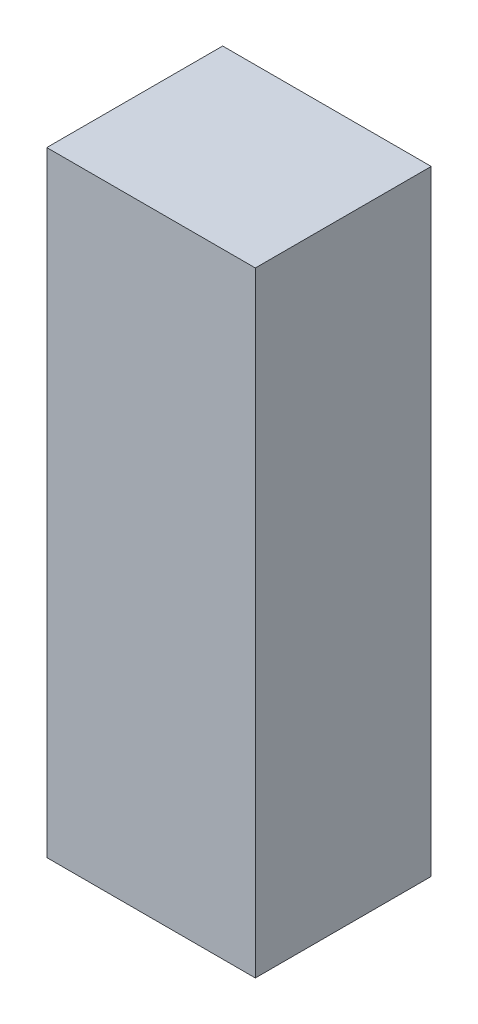
ISO-10303-21;
HEADER;
FILE_DESCRIPTION(('STEP AP214'),'2;1');
FILE_NAME('part.step','',(''),(''),'','','');
FILE_SCHEMA(('AUTOMOTIVE_DESIGN { 1 0 10303 214 1 1 1 1 }'));
ENDSEC;
DATA;
#1=APPLICATION_CONTEXT('core data for automotive mechanical design processes');
#2=APPLICATION_PROTOCOL_DEFINITION('international standard','automotive_design',2000,#1);
#3=PRODUCT_CONTEXT('',#1,'mechanical');
#4=PRODUCT('Part','Part','',(#3));
#5=PRODUCT_RELATED_PRODUCT_CATEGORY('part','',(#4));
#6=PRODUCT_DEFINITION_FORMATION('','',#4);
#7=PRODUCT_DEFINITION_CONTEXT('part definition',#1,'design');
#8=PRODUCT_DEFINITION('design','',#6,#7);
#9=PRODUCT_DEFINITION_SHAPE('','',#8);
#10=(LENGTH_UNIT() NAMED_UNIT(*) SI_UNIT(.MILLI.,.METRE.));
#11=(NAMED_UNIT(*) PLANE_ANGLE_UNIT() SI_UNIT($,.RADIAN.));
#12=(NAMED_UNIT(*) SI_UNIT($,.STERADIAN.) SOLID_ANGLE_UNIT());
#13=UNCERTAINTY_MEASURE_WITH_UNIT(LENGTH_MEASURE(1.E-05),#10,'distance_accuracy_value','');
#14=(GEOMETRIC_REPRESENTATION_CONTEXT(3) GLOBAL_UNCERTAINTY_ASSIGNED_CONTEXT((#13)) GLOBAL_UNIT_ASSIGNED_CONTEXT((#10,
#11,#12)) REPRESENTATION_CONTEXT('',''));
#15=CARTESIAN_POINT('',(0.,0.,0.));
#16=DIRECTION('',(0.,0.,1.));
#17=DIRECTION('',(1.,0.,0.));
#18=AXIS2_PLACEMENT_3D('',#15,#16,#17);
#19=CARTESIAN_POINT('',(0.,137.4,0.));
#20=DIRECTION('',(1.,0.,0.));
#21=DIRECTION('',(0.,0.,-1.));
#22=AXIS2_PLACEMENT_3D('',#19,#20,#21);
#23=PLANE('',#22);
#24=DIRECTION('',(0.,0.,1.));
#25=VECTOR('',#24,1.);
#26=CARTESIAN_POINT('',(0.,0.,0.));
#27=LINE('',#26,#25);
#28=CARTESIAN_POINT('',(0.,0.,-39.3));
#29=VERTEX_POINT('',#28);
#30=CARTESIAN_POINT('',(0.,0.,0.));
#31=VERTEX_POINT('',#30);
#32=EDGE_CURVE('E97',#29,#31,#27,.T.);
#33=ORIENTED_EDGE('',*,*,#32,.T.);
#34=DIRECTION('',(0.,-1.,0.));
#35=VECTOR('',#34,1.);
#36=CARTESIAN_POINT('',(0.,137.4,0.));
#37=LINE('',#36,#35);
#38=CARTESIAN_POINT('',(0.,137.4,0.));
#39=VERTEX_POINT('',#38);
#40=EDGE_CURVE('E11',#39,#31,#37,.T.);
#41=ORIENTED_EDGE('',*,*,#40,.F.);
#42=DIRECTION('',(0.,0.,1.));
#43=VECTOR('',#42,1.);
#44=CARTESIAN_POINT('',(0.,137.4,0.));
#45=LINE('',#44,#43);
#46=CARTESIAN_POINT('',(0.,137.4,-39.3));
#47=VERTEX_POINT('',#46);
#48=EDGE_CURVE('E85',#47,#39,#45,.T.);
#49=ORIENTED_EDGE('',*,*,#48,.F.);
#50=DIRECTION('',(0.,-1.,0.));
#51=VECTOR('',#50,1.);
#52=CARTESIAN_POINT('',(0.,137.4,-39.3));
#53=LINE('',#52,#51);
#54=EDGE_CURVE('E93',#47,#29,#53,.T.);
#55=ORIENTED_EDGE('',*,*,#54,.T.);
#56=EDGE_LOOP('',(#33,#41,#49,#55));
#57=FACE_BOUND('',#56,.T.);
#58=ADVANCED_FACE('F34',(#57),#23,.F.);
#59=CARTESIAN_POINT('',(0.,137.4,0.));
#60=DIRECTION('',(0.,0.,-1.));
#61=DIRECTION('',(-1.,0.,0.));
#62=AXIS2_PLACEMENT_3D('',#59,#60,#61);
#63=PLANE('',#62);
#64=DIRECTION('',(1.,0.,0.));
#65=VECTOR('',#64,1.);
#66=CARTESIAN_POINT('',(0.,0.,0.));
#67=LINE('',#66,#65);
#68=CARTESIAN_POINT('',(46.6,0.,0.));
#69=VERTEX_POINT('',#68);
#70=EDGE_CURVE('E89',#31,#69,#67,.T.);
#71=ORIENTED_EDGE('',*,*,#70,.T.);
#72=DIRECTION('',(0.,-1.,0.));
#73=VECTOR('',#72,1.);
#74=CARTESIAN_POINT('',(46.6,137.4,0.));
#75=LINE('',#74,#73);
#76=CARTESIAN_POINT('',(46.6,137.4,0.));
#77=VERTEX_POINT('',#76);
#78=EDGE_CURVE('E42',#77,#69,#75,.T.);
#79=ORIENTED_EDGE('',*,*,#78,.F.);
#80=DIRECTION('',(1.,0.,0.));
#81=VECTOR('',#80,1.);
#82=CARTESIAN_POINT('',(0.,137.4,0.));
#83=LINE('',#82,#81);
#84=EDGE_CURVE('E80',#39,#77,#83,.T.);
#85=ORIENTED_EDGE('',*,*,#84,.F.);
#86=ORIENTED_EDGE('',*,*,#40,.T.);
#87=EDGE_LOOP('',(#71,#79,#85,#86));
#88=FACE_BOUND('',#87,.T.);
#89=ADVANCED_FACE('F88',(#88),#63,.F.);
#90=CARTESIAN_POINT('',(46.6,137.4,0.));
#91=DIRECTION('',(-1.,0.,0.));
#92=DIRECTION('',(0.,0.,1.));
#93=AXIS2_PLACEMENT_3D('',#90,#91,#92);
#94=PLANE('',#93);
#95=DIRECTION('',(0.,0.,-1.));
#96=VECTOR('',#95,1.);
#97=CARTESIAN_POINT('',(46.6,0.,0.));
#98=LINE('',#97,#96);
#99=CARTESIAN_POINT('',(46.6,0.,-39.3));
#100=VERTEX_POINT('',#99);
#101=EDGE_CURVE('E67',#69,#100,#98,.T.);
#102=ORIENTED_EDGE('',*,*,#101,.T.);
#103=DIRECTION('',(0.,-1.,0.));
#104=VECTOR('',#103,1.);
#105=CARTESIAN_POINT('',(46.6,137.4,-39.3));
#106=LINE('',#105,#104);
#107=CARTESIAN_POINT('',(46.6,137.4,-39.3));
#108=VERTEX_POINT('',#107);
#109=EDGE_CURVE('E90',#108,#100,#106,.T.);
#110=ORIENTED_EDGE('',*,*,#109,.F.);
#111=DIRECTION('',(0.,0.,-1.));
#112=VECTOR('',#111,1.);
#113=CARTESIAN_POINT('',(46.6,137.4,0.));
#114=LINE('',#113,#112);
#115=EDGE_CURVE('E83',#77,#108,#114,.T.);
#116=ORIENTED_EDGE('',*,*,#115,.F.);
#117=ORIENTED_EDGE('',*,*,#78,.T.);
#118=EDGE_LOOP('',(#102,#110,#116,#117));
#119=FACE_BOUND('',#118,.T.);
#120=ADVANCED_FACE('F91',(#119),#94,.F.);
#121=CARTESIAN_POINT('',(0.,137.4,-39.3));
#122=DIRECTION('',(0.,0.,1.));
#123=DIRECTION('',(1.,0.,0.));
#124=AXIS2_PLACEMENT_3D('',#121,#122,#123);
#125=PLANE('',#124);
#126=DIRECTION('',(-1.,0.,0.));
#127=VECTOR('',#126,1.);
#128=CARTESIAN_POINT('',(0.,0.,-39.3));
#129=LINE('',#128,#127);
#130=EDGE_CURVE('E73',#100,#29,#129,.T.);
#131=ORIENTED_EDGE('',*,*,#130,.T.);
#132=ORIENTED_EDGE('',*,*,#54,.F.);
#133=DIRECTION('',(-1.,0.,0.));
#134=VECTOR('',#133,1.);
#135=CARTESIAN_POINT('',(0.,137.4,-39.3));
#136=LINE('',#135,#134);
#137=EDGE_CURVE('E50',#108,#47,#136,.T.);
#138=ORIENTED_EDGE('',*,*,#137,.F.);
#139=ORIENTED_EDGE('',*,*,#109,.T.);
#140=EDGE_LOOP('',(#131,#132,#138,#139));
#141=FACE_BOUND('',#140,.T.);
#142=ADVANCED_FACE('F104',(#141),#125,.F.);
#143=CARTESIAN_POINT('',(0.,137.4,0.));
#144=DIRECTION('',(0.,-1.,0.));
#145=DIRECTION('',(0.,0.,-1.));
#146=AXIS2_PLACEMENT_3D('',#143,#144,#145);
#147=PLANE('',#146);
#148=ORIENTED_EDGE('',*,*,#48,.T.);
#149=ORIENTED_EDGE('',*,*,#84,.T.);
#150=ORIENTED_EDGE('',*,*,#115,.T.);
#151=ORIENTED_EDGE('',*,*,#137,.T.);
#152=EDGE_LOOP('',(#148,#149,#150,#151));
#153=FACE_BOUND('',#152,.T.);
#154=ADVANCED_FACE('F81',(#153),#147,.F.);
#155=CARTESIAN_POINT('',(0.,0.,0.));
#156=DIRECTION('',(0.,-1.,0.));
#157=DIRECTION('',(0.,0.,-1.));
#158=AXIS2_PLACEMENT_3D('',#155,#156,#157);
#159=PLANE('',#158);
#160=ORIENTED_EDGE('',*,*,#32,.F.);
#161=ORIENTED_EDGE('',*,*,#130,.F.);
#162=ORIENTED_EDGE('',*,*,#101,.F.);
#163=ORIENTED_EDGE('',*,*,#70,.F.);
#164=EDGE_LOOP('',(#160,#161,#162,#163));
#165=FACE_BOUND('',#164,.T.);
#166=ADVANCED_FACE('F107',(#165),#159,.T.);
#167=CLOSED_SHELL('',(#58,#89,#120,#142,#154,#166));
#168=MANIFOLD_SOLID_BREP('B2',#167);
#169=ADVANCED_BREP_SHAPE_REPRESENTATION('',(#18,#168),#14);
#170=SHAPE_DEFINITION_REPRESENTATION(#9,#169);
ENDSEC;
END-ISO-10303-21;
